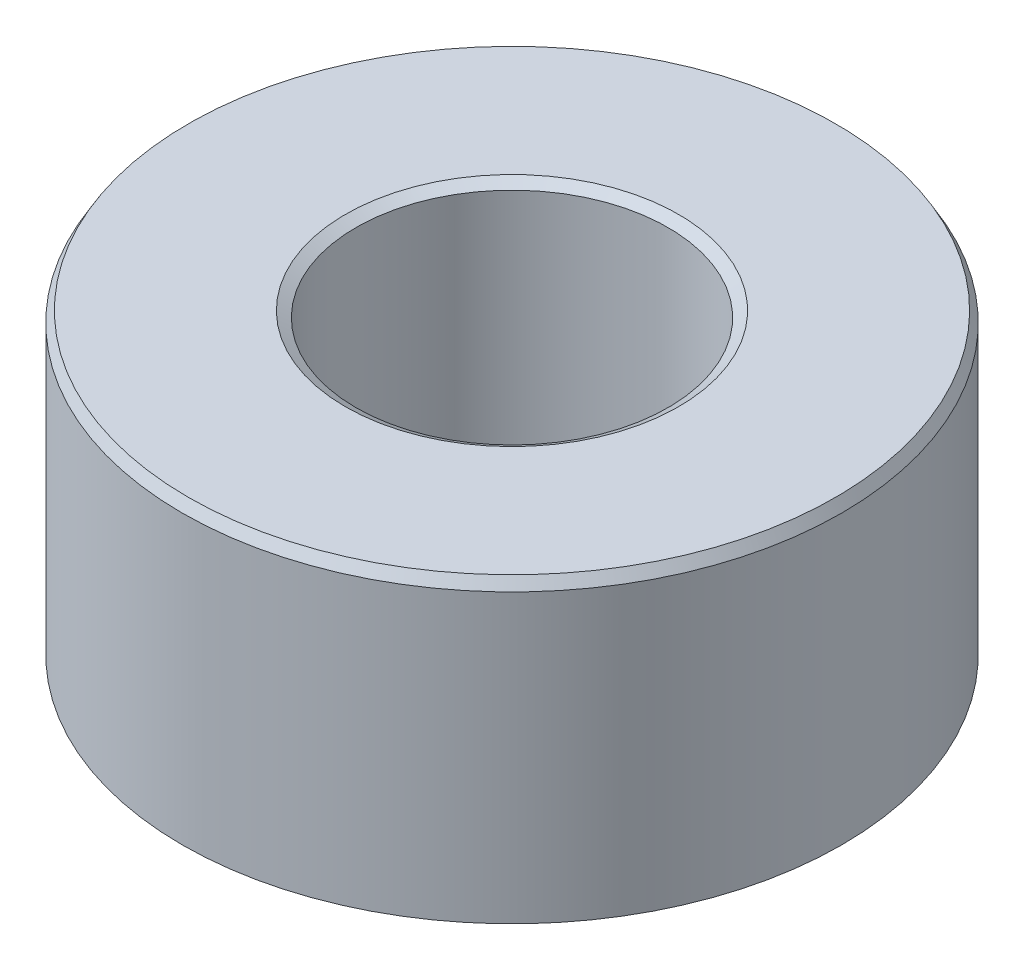
ISO-10303-21;
HEADER;
FILE_DESCRIPTION(('STEP AP214'),'2;1');
FILE_NAME('part.step','',(''),(''),'','','');
FILE_SCHEMA(('AUTOMOTIVE_DESIGN { 1 0 10303 214 1 1 1 1 }'));
ENDSEC;
DATA;
#1=APPLICATION_CONTEXT('core data for automotive mechanical design processes');
#2=APPLICATION_PROTOCOL_DEFINITION('international standard','automotive_design',2000,#1);
#3=PRODUCT_CONTEXT('',#1,'mechanical');
#4=PRODUCT('Part','Part','',(#3));
#5=PRODUCT_RELATED_PRODUCT_CATEGORY('part','',(#4));
#6=PRODUCT_DEFINITION_FORMATION('','',#4);
#7=PRODUCT_DEFINITION_CONTEXT('part definition',#1,'design');
#8=PRODUCT_DEFINITION('design','',#6,#7);
#9=PRODUCT_DEFINITION_SHAPE('','',#8);
#10=(LENGTH_UNIT() NAMED_UNIT(*) SI_UNIT(.MILLI.,.METRE.));
#11=(NAMED_UNIT(*) PLANE_ANGLE_UNIT() SI_UNIT($,.RADIAN.));
#12=(NAMED_UNIT(*) SI_UNIT($,.STERADIAN.) SOLID_ANGLE_UNIT());
#13=UNCERTAINTY_MEASURE_WITH_UNIT(LENGTH_MEASURE(1.E-05),#10,'distance_accuracy_value','');
#14=(GEOMETRIC_REPRESENTATION_CONTEXT(3) GLOBAL_UNCERTAINTY_ASSIGNED_CONTEXT((#13)) GLOBAL_UNIT_ASSIGNED_CONTEXT((#10,
#11,#12)) REPRESENTATION_CONTEXT('',''));
#15=CARTESIAN_POINT('',(0.,0.,0.));
#16=DIRECTION('',(0.,0.,1.));
#17=DIRECTION('',(1.,0.,0.));
#18=AXIS2_PLACEMENT_3D('',#15,#16,#17);
#19=CARTESIAN_POINT('',(0.,6.91696381675812,0.));
#20=DIRECTION('',(0.,-1.,0.));
#21=DIRECTION('',(0.,0.,-1.));
#22=AXIS2_PLACEMENT_3D('',#19,#20,#21);
#23=CYLINDRICAL_SURFACE('',#22,7.5);
#24=CARTESIAN_POINT('',(0.,0.138803188737715,0.));
#25=DIRECTION('',(0.,1.,0.));
#26=DIRECTION('',(0.,0.,1.));
#27=AXIS2_PLACEMENT_3D('',#24,#25,#26);
#28=CIRCLE('',#27,7.5);
#29=CARTESIAN_POINT('',(0.,0.138803188737715,7.5));
#30=VERTEX_POINT('',#29);
#31=EDGE_CURVE('E10',#30,#30,#28,.T.);
#32=ORIENTED_EDGE('',*,*,#31,.T.);
#33=EDGE_LOOP('',(#32));
#34=FACE_BOUND('',#33,.T.);
#35=CARTESIAN_POINT('',(0.,6.67654964161182,0.));
#36=DIRECTION('',(0.,1.,0.));
#37=DIRECTION('',(0.,0.,1.));
#38=AXIS2_PLACEMENT_3D('',#35,#36,#37);
#39=CIRCLE('',#38,7.5);
#40=CARTESIAN_POINT('',(0.,6.67654964161182,7.5));
#41=VERTEX_POINT('',#40);
#42=EDGE_CURVE('E50',#41,#41,#39,.F.);
#43=ORIENTED_EDGE('',*,*,#42,.T.);
#44=EDGE_LOOP('',(#43));
#45=FACE_BOUND('',#44,.T.);
#46=ADVANCED_FACE('F39',(#34,#45),#23,.T.);
#47=CARTESIAN_POINT('',(0.,6.91696381675812,0.));
#48=DIRECTION('',(0.,1.,0.));
#49=DIRECTION('',(0.,0.,1.));
#50=AXIS2_PLACEMENT_3D('',#47,#48,#49);
#51=PLANE('',#50);
#52=CARTESIAN_POINT('',(0.,6.91696381675812,0.));
#53=DIRECTION('',(0.,1.,0.));
#54=DIRECTION('',(0.,0.,1.));
#55=AXIS2_PLACEMENT_3D('',#52,#53,#54);
#56=CIRCLE('',#55,3.79037045410747);
#57=CARTESIAN_POINT('',(0.,6.91696381675812,3.79037045410747));
#58=VERTEX_POINT('',#57);
#59=EDGE_CURVE('E58',#58,#58,#56,.F.);
#60=ORIENTED_EDGE('',*,*,#59,.T.);
#61=EDGE_LOOP('',(#60));
#62=FACE_BOUND('',#61,.T.);
#63=CARTESIAN_POINT('',(0.,6.91696381675812,0.));
#64=DIRECTION('',(0.,1.,0.));
#65=DIRECTION('',(0.,0.,1.));
#66=AXIS2_PLACEMENT_3D('',#63,#64,#65);
#67=CIRCLE('',#66,7.36119681126228);
#68=CARTESIAN_POINT('',(0.,6.91696381675812,7.36119681126228));
#69=VERTEX_POINT('',#68);
#70=EDGE_CURVE('E61',#69,#69,#67,.T.);
#71=ORIENTED_EDGE('',*,*,#70,.T.);
#72=EDGE_LOOP('',(#71));
#73=FACE_BOUND('',#72,.T.);
#74=ADVANCED_FACE('F88',(#62,#73),#51,.T.);
#75=CARTESIAN_POINT('',(0.,0.,0.));
#76=DIRECTION('',(0.,1.,0.));
#77=DIRECTION('',(0.,0.,1.));
#78=AXIS2_PLACEMENT_3D('',#75,#76,#77);
#79=PLANE('',#78);
#80=CARTESIAN_POINT('',(0.,0.,0.));
#81=DIRECTION('',(0.,1.,0.));
#82=DIRECTION('',(0.,0.,1.));
#83=AXIS2_PLACEMENT_3D('',#80,#81,#82);
#84=CIRCLE('',#83,3.68875946769889);
#85=CARTESIAN_POINT('',(0.,0.,3.68875946769889));
#86=VERTEX_POINT('',#85);
#87=EDGE_CURVE('E51',#86,#86,#84,.T.);
#88=ORIENTED_EDGE('',*,*,#87,.T.);
#89=EDGE_LOOP('',(#88));
#90=FACE_BOUND('',#89,.T.);
#91=CARTESIAN_POINT('',(0.,0.,0.));
#92=DIRECTION('',(0.,1.,0.));
#93=DIRECTION('',(0.,0.,1.));
#94=AXIS2_PLACEMENT_3D('',#91,#92,#93);
#95=CIRCLE('',#94,7.2595858248537);
#96=CARTESIAN_POINT('',(0.,0.,7.2595858248537));
#97=VERTEX_POINT('',#96);
#98=EDGE_CURVE('E54',#97,#97,#95,.F.);
#99=ORIENTED_EDGE('',*,*,#98,.T.);
#100=EDGE_LOOP('',(#99));
#101=FACE_BOUND('',#100,.T.);
#102=ADVANCED_FACE('F83',(#90,#101),#79,.F.);
#103=CARTESIAN_POINT('',(0.,6.91696381675812,0.));
#104=DIRECTION('',(0.,-1.,0.));
#105=DIRECTION('',(0.,0.,-1.));
#106=AXIS2_PLACEMENT_3D('',#103,#104,#105);
#107=CYLINDRICAL_SURFACE('',#106,3.54995627896117);
#108=CARTESIAN_POINT('',(0.,6.7781606280204,0.));
#109=DIRECTION('',(0.,1.,0.));
#110=DIRECTION('',(0.,0.,1.));
#111=AXIS2_PLACEMENT_3D('',#108,#109,#110);
#112=CIRCLE('',#111,3.54995627896117);
#113=CARTESIAN_POINT('',(0.,6.7781606280204,3.54995627896117));
#114=VERTEX_POINT('',#113);
#115=EDGE_CURVE('E67',#114,#114,#112,.T.);
#116=ORIENTED_EDGE('',*,*,#115,.T.);
#117=EDGE_LOOP('',(#116));
#118=FACE_BOUND('',#117,.T.);
#119=CARTESIAN_POINT('',(0.,0.240414175146299,0.));
#120=DIRECTION('',(0.,1.,0.));
#121=DIRECTION('',(0.,0.,1.));
#122=AXIS2_PLACEMENT_3D('',#119,#120,#121);
#123=CIRCLE('',#122,3.54995627896117);
#124=CARTESIAN_POINT('',(0.,0.240414175146299,3.54995627896117));
#125=VERTEX_POINT('',#124);
#126=EDGE_CURVE('E69',#125,#125,#123,.F.);
#127=ORIENTED_EDGE('',*,*,#126,.T.);
#128=EDGE_LOOP('',(#127));
#129=FACE_BOUND('',#128,.T.);
#130=ADVANCED_FACE('F71',(#118,#129),#107,.F.);
#131=CARTESIAN_POINT('',(0.,6.7781606280204,0.));
#132=DIRECTION('',(0.,1.,0.));
#133=DIRECTION('',(0.,0.,1.));
#134=AXIS2_PLACEMENT_3D('',#131,#132,#133);
#135=CONICAL_SURFACE('',#134,3.54995627896117,1.04719755119661);
#136=ORIENTED_EDGE('',*,*,#59,.F.);
#137=EDGE_LOOP('',(#136));
#138=FACE_BOUND('',#137,.T.);
#139=ORIENTED_EDGE('',*,*,#115,.F.);
#140=EDGE_LOOP('',(#139));
#141=FACE_BOUND('',#140,.T.);
#142=ADVANCED_FACE('F77',(#138,#141),#135,.F.);
#143=CARTESIAN_POINT('',(0.,0.,0.));
#144=DIRECTION('',(0.,-1.,0.));
#145=DIRECTION('',(0.,0.,-1.));
#146=AXIS2_PLACEMENT_3D('',#143,#144,#145);
#147=CONICAL_SURFACE('',#146,3.68875946769889,0.523598775598296);
#148=ORIENTED_EDGE('',*,*,#126,.F.);
#149=EDGE_LOOP('',(#148));
#150=FACE_BOUND('',#149,.T.);
#151=ORIENTED_EDGE('',*,*,#87,.F.);
#152=EDGE_LOOP('',(#151));
#153=FACE_BOUND('',#152,.T.);
#154=ADVANCED_FACE('F73',(#150,#153),#147,.F.);
#155=CARTESIAN_POINT('',(0.,0.138803188737715,0.));
#156=DIRECTION('',(0.,1.,0.));
#157=DIRECTION('',(0.,0.,1.));
#158=AXIS2_PLACEMENT_3D('',#155,#156,#157);
#159=CONICAL_SURFACE('',#158,7.5,1.0471975511966);
#160=ORIENTED_EDGE('',*,*,#98,.F.);
#161=EDGE_LOOP('',(#160));
#162=FACE_BOUND('',#161,.T.);
#163=ORIENTED_EDGE('',*,*,#31,.F.);
#164=EDGE_LOOP('',(#163));
#165=FACE_BOUND('',#164,.T.);
#166=ADVANCED_FACE('F76',(#162,#165),#159,.T.);
#167=CARTESIAN_POINT('',(0.,6.91696381675812,0.));
#168=DIRECTION('',(0.,-1.,0.));
#169=DIRECTION('',(0.,0.,-1.));
#170=AXIS2_PLACEMENT_3D('',#167,#168,#169);
#171=CONICAL_SURFACE('',#170,7.36119681126228,0.523598775598298);
#172=ORIENTED_EDGE('',*,*,#42,.F.);
#173=EDGE_LOOP('',(#172));
#174=FACE_BOUND('',#173,.T.);
#175=ORIENTED_EDGE('',*,*,#70,.F.);
#176=EDGE_LOOP('',(#175));
#177=FACE_BOUND('',#176,.T.);
#178=ADVANCED_FACE('F45',(#174,#177),#171,.T.);
#179=CLOSED_SHELL('',(#46,#74,#102,#130,#142,#154,#166,#178));
#180=MANIFOLD_SOLID_BREP('B2',#179);
#181=ADVANCED_BREP_SHAPE_REPRESENTATION('',(#18,#180),#14);
#182=SHAPE_DEFINITION_REPRESENTATION(#9,#181);
ENDSEC;
END-ISO-10303-21;
